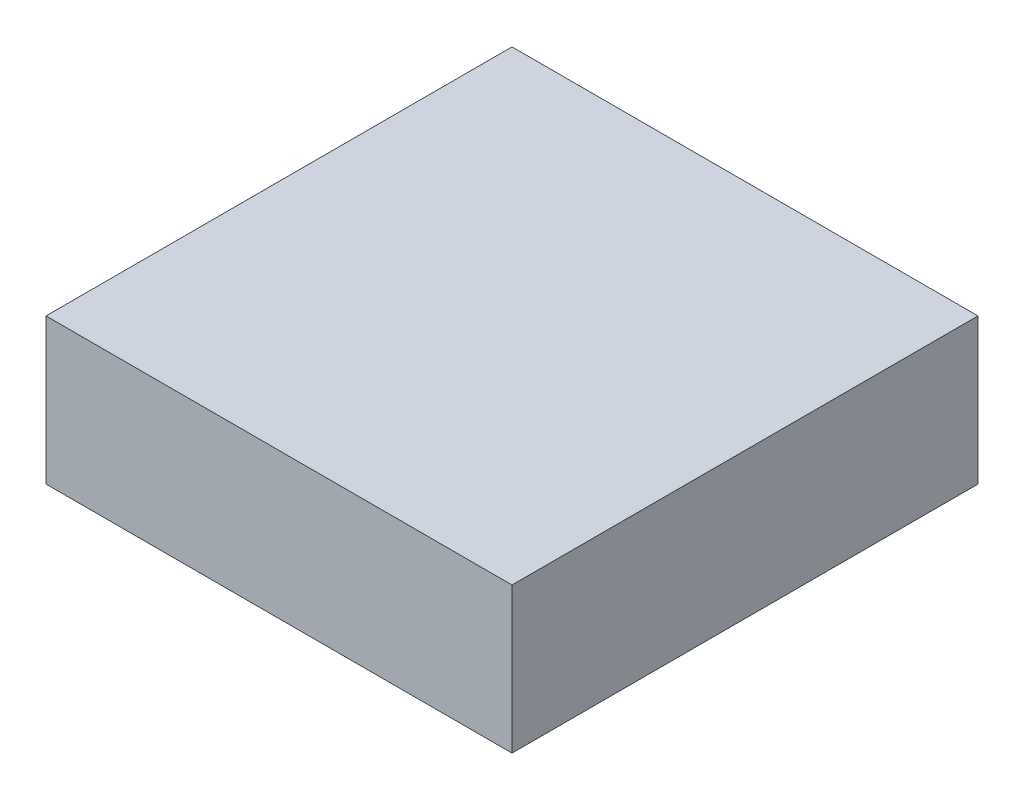
ISO-10303-21;
HEADER;
FILE_DESCRIPTION(('STEP AP214'),'2;1');
FILE_NAME('part.step','',(''),(''),'','','');
FILE_SCHEMA(('AUTOMOTIVE_DESIGN { 1 0 10303 214 1 1 1 1 }'));
ENDSEC;
DATA;
#1=APPLICATION_CONTEXT('core data for automotive mechanical design processes');
#2=APPLICATION_PROTOCOL_DEFINITION('international standard','automotive_design',2000,#1);
#3=PRODUCT_CONTEXT('',#1,'mechanical');
#4=PRODUCT('Part','Part','',(#3));
#5=PRODUCT_RELATED_PRODUCT_CATEGORY('part','',(#4));
#6=PRODUCT_DEFINITION_FORMATION('','',#4);
#7=PRODUCT_DEFINITION_CONTEXT('part definition',#1,'design');
#8=PRODUCT_DEFINITION('design','',#6,#7);
#9=PRODUCT_DEFINITION_SHAPE('','',#8);
#10=(LENGTH_UNIT() NAMED_UNIT(*) SI_UNIT(.MILLI.,.METRE.));
#11=(NAMED_UNIT(*) PLANE_ANGLE_UNIT() SI_UNIT($,.RADIAN.));
#12=(NAMED_UNIT(*) SI_UNIT($,.STERADIAN.) SOLID_ANGLE_UNIT());
#13=UNCERTAINTY_MEASURE_WITH_UNIT(LENGTH_MEASURE(1.E-05),#10,'distance_accuracy_value','');
#14=(GEOMETRIC_REPRESENTATION_CONTEXT(3) GLOBAL_UNCERTAINTY_ASSIGNED_CONTEXT((#13)) GLOBAL_UNIT_ASSIGNED_CONTEXT((#10,
#11,#12)) REPRESENTATION_CONTEXT('',''));
#15=CARTESIAN_POINT('',(0.,0.,0.));
#16=DIRECTION('',(0.,0.,1.));
#17=DIRECTION('',(1.,0.,0.));
#18=AXIS2_PLACEMENT_3D('',#15,#16,#17);
#19=CARTESIAN_POINT('',(0.80000094,0.2499995,0.));
#20=DIRECTION('',(0.,-1.,0.));
#21=DIRECTION('',(0.,0.,-1.));
#22=AXIS2_PLACEMENT_3D('',#19,#20,#21);
#23=PLANE('',#22);
#24=DIRECTION('',(0.,0.,-1.));
#25=VECTOR('',#24,1.);
#26=CARTESIAN_POINT('',(-0.7999984,0.2499995,0.));
#27=LINE('',#26,#25);
#28=CARTESIAN_POINT('',(-0.7999984,0.2499995,0.));
#29=VERTEX_POINT('',#28);
#30=CARTESIAN_POINT('',(-0.7999984,0.2499995,1.59999934));
#31=VERTEX_POINT('',#30);
#32=EDGE_CURVE('E20',#29,#31,#27,.F.);
#33=ORIENTED_EDGE('',*,*,#32,.T.);
#34=DIRECTION('',(-1.,0.,0.));
#35=VECTOR('',#34,1.);
#36=CARTESIAN_POINT('',(-0.7999984,0.2499995,1.59999934));
#37=LINE('',#36,#35);
#38=CARTESIAN_POINT('',(0.80000094,0.2499995,1.59999934));
#39=VERTEX_POINT('',#38);
#40=EDGE_CURVE('E55',#31,#39,#37,.F.);
#41=ORIENTED_EDGE('',*,*,#40,.T.);
#42=DIRECTION('',(0.,0.,1.));
#43=VECTOR('',#42,1.);
#44=CARTESIAN_POINT('',(0.80000094,0.2499995,0.));
#45=LINE('',#44,#43);
#46=CARTESIAN_POINT('',(0.80000094,0.2499995,0.));
#47=VERTEX_POINT('',#46);
#48=EDGE_CURVE('E76',#39,#47,#45,.F.);
#49=ORIENTED_EDGE('',*,*,#48,.T.);
#50=DIRECTION('',(-1.,0.,0.));
#51=VECTOR('',#50,1.);
#52=CARTESIAN_POINT('',(-0.7999984,0.2499995,0.));
#53=LINE('',#52,#51);
#54=EDGE_CURVE('E58',#29,#47,#53,.F.);
#55=ORIENTED_EDGE('',*,*,#54,.F.);
#56=EDGE_LOOP('',(#33,#41,#49,#55));
#57=FACE_BOUND('',#56,.T.);
#58=ADVANCED_FACE('F17',(#57),#23,.F.);
#59=CARTESIAN_POINT('',(-0.7999984,0.2499995,0.));
#60=DIRECTION('',(1.,0.,0.));
#61=DIRECTION('',(0.,0.,-1.));
#62=AXIS2_PLACEMENT_3D('',#59,#60,#61);
#63=PLANE('',#62);
#64=DIRECTION('',(0.,0.,1.));
#65=VECTOR('',#64,1.);
#66=CARTESIAN_POINT('',(-0.7999984,-0.2499995,0.));
#67=LINE('',#66,#65);
#68=CARTESIAN_POINT('',(-0.7999984,-0.2499995,0.));
#69=VERTEX_POINT('',#68);
#70=CARTESIAN_POINT('',(-0.7999984,-0.2499995,1.59999934));
#71=VERTEX_POINT('',#70);
#72=EDGE_CURVE('E73',#69,#71,#67,.T.);
#73=ORIENTED_EDGE('',*,*,#72,.T.);
#74=DIRECTION('',(0.,1.,0.));
#75=VECTOR('',#74,1.);
#76=CARTESIAN_POINT('',(-0.7999984,-0.2499995,1.59999934));
#77=LINE('',#76,#75);
#78=EDGE_CURVE('E63',#71,#31,#77,.T.);
#79=ORIENTED_EDGE('',*,*,#78,.T.);
#80=ORIENTED_EDGE('',*,*,#32,.F.);
#81=DIRECTION('',(0.,1.,0.));
#82=VECTOR('',#81,1.);
#83=CARTESIAN_POINT('',(-0.7999984,-0.2499995,0.));
#84=LINE('',#83,#82);
#85=EDGE_CURVE('E78',#69,#29,#84,.T.);
#86=ORIENTED_EDGE('',*,*,#85,.F.);
#87=EDGE_LOOP('',(#73,#79,#80,#86));
#88=FACE_BOUND('',#87,.T.);
#89=ADVANCED_FACE('F72',(#88),#63,.F.);
#90=CARTESIAN_POINT('',(-0.7999984,-0.2499995,1.59999934));
#91=DIRECTION('',(0.,0.,-1.));
#92=DIRECTION('',(-1.,0.,0.));
#93=AXIS2_PLACEMENT_3D('',#90,#91,#92);
#94=PLANE('',#93);
#95=DIRECTION('',(0.,1.,0.));
#96=VECTOR('',#95,1.);
#97=CARTESIAN_POINT('',(0.80000094,-0.2499995,1.59999934));
#98=LINE('',#97,#96);
#99=CARTESIAN_POINT('',(0.80000094,-0.2499995,1.59999934));
#100=VERTEX_POINT('',#99);
#101=EDGE_CURVE('E69',#100,#39,#98,.T.);
#102=ORIENTED_EDGE('',*,*,#101,.T.);
#103=ORIENTED_EDGE('',*,*,#40,.F.);
#104=ORIENTED_EDGE('',*,*,#78,.F.);
#105=DIRECTION('',(1.,0.,0.));
#106=VECTOR('',#105,1.);
#107=CARTESIAN_POINT('',(-0.7999984,-0.2499995,1.59999934));
#108=LINE('',#107,#106);
#109=EDGE_CURVE('E83',#71,#100,#108,.T.);
#110=ORIENTED_EDGE('',*,*,#109,.T.);
#111=EDGE_LOOP('',(#102,#103,#104,#110));
#112=FACE_BOUND('',#111,.T.);
#113=ADVANCED_FACE('F66',(#112),#94,.F.);
#114=CARTESIAN_POINT('',(0.80000094,-0.2499995,0.));
#115=DIRECTION('',(-1.,0.,0.));
#116=DIRECTION('',(0.,0.,1.));
#117=AXIS2_PLACEMENT_3D('',#114,#115,#116);
#118=PLANE('',#117);
#119=ORIENTED_EDGE('',*,*,#48,.F.);
#120=ORIENTED_EDGE('',*,*,#101,.F.);
#121=DIRECTION('',(0.,0.,1.));
#122=VECTOR('',#121,1.);
#123=CARTESIAN_POINT('',(0.80000094,-0.2499995,0.));
#124=LINE('',#123,#122);
#125=CARTESIAN_POINT('',(0.80000094,-0.2499995,0.));
#126=VERTEX_POINT('',#125);
#127=EDGE_CURVE('E26',#100,#126,#124,.F.);
#128=ORIENTED_EDGE('',*,*,#127,.T.);
#129=DIRECTION('',(0.,1.,0.));
#130=VECTOR('',#129,1.);
#131=CARTESIAN_POINT('',(0.80000094,-0.2499995,0.));
#132=LINE('',#131,#130);
#133=EDGE_CURVE('E34',#47,#126,#132,.F.);
#134=ORIENTED_EDGE('',*,*,#133,.F.);
#135=EDGE_LOOP('',(#119,#120,#128,#134));
#136=FACE_BOUND('',#135,.T.);
#137=ADVANCED_FACE('F88',(#136),#118,.F.);
#138=CARTESIAN_POINT('',(-0.7999984,-0.2499995,0.));
#139=DIRECTION('',(0.,0.,-1.));
#140=DIRECTION('',(-1.,0.,0.));
#141=AXIS2_PLACEMENT_3D('',#138,#139,#140);
#142=PLANE('',#141);
#143=ORIENTED_EDGE('',*,*,#133,.T.);
#144=DIRECTION('',(1.,0.,0.));
#145=VECTOR('',#144,1.);
#146=CARTESIAN_POINT('',(-0.7999984,-0.2499995,0.));
#147=LINE('',#146,#145);
#148=EDGE_CURVE('E11',#126,#69,#147,.F.);
#149=ORIENTED_EDGE('',*,*,#148,.T.);
#150=ORIENTED_EDGE('',*,*,#85,.T.);
#151=ORIENTED_EDGE('',*,*,#54,.T.);
#152=EDGE_LOOP('',(#143,#149,#150,#151));
#153=FACE_BOUND('',#152,.T.);
#154=ADVANCED_FACE('F91',(#153),#142,.T.);
#155=CARTESIAN_POINT('',(-0.7999984,-0.2499995,0.));
#156=DIRECTION('',(0.,1.,0.));
#157=DIRECTION('',(0.,0.,1.));
#158=AXIS2_PLACEMENT_3D('',#155,#156,#157);
#159=PLANE('',#158);
#160=ORIENTED_EDGE('',*,*,#127,.F.);
#161=ORIENTED_EDGE('',*,*,#109,.F.);
#162=ORIENTED_EDGE('',*,*,#72,.F.);
#163=ORIENTED_EDGE('',*,*,#148,.F.);
#164=EDGE_LOOP('',(#160,#161,#162,#163));
#165=FACE_BOUND('',#164,.T.);
#166=ADVANCED_FACE('F90',(#165),#159,.F.);
#167=CLOSED_SHELL('',(#58,#89,#113,#137,#154,#166));
#168=MANIFOLD_SOLID_BREP('B1',#167);
#169=ADVANCED_BREP_SHAPE_REPRESENTATION('',(#18,#168),#14);
#170=SHAPE_DEFINITION_REPRESENTATION(#9,#169);
ENDSEC;
END-ISO-10303-21;
